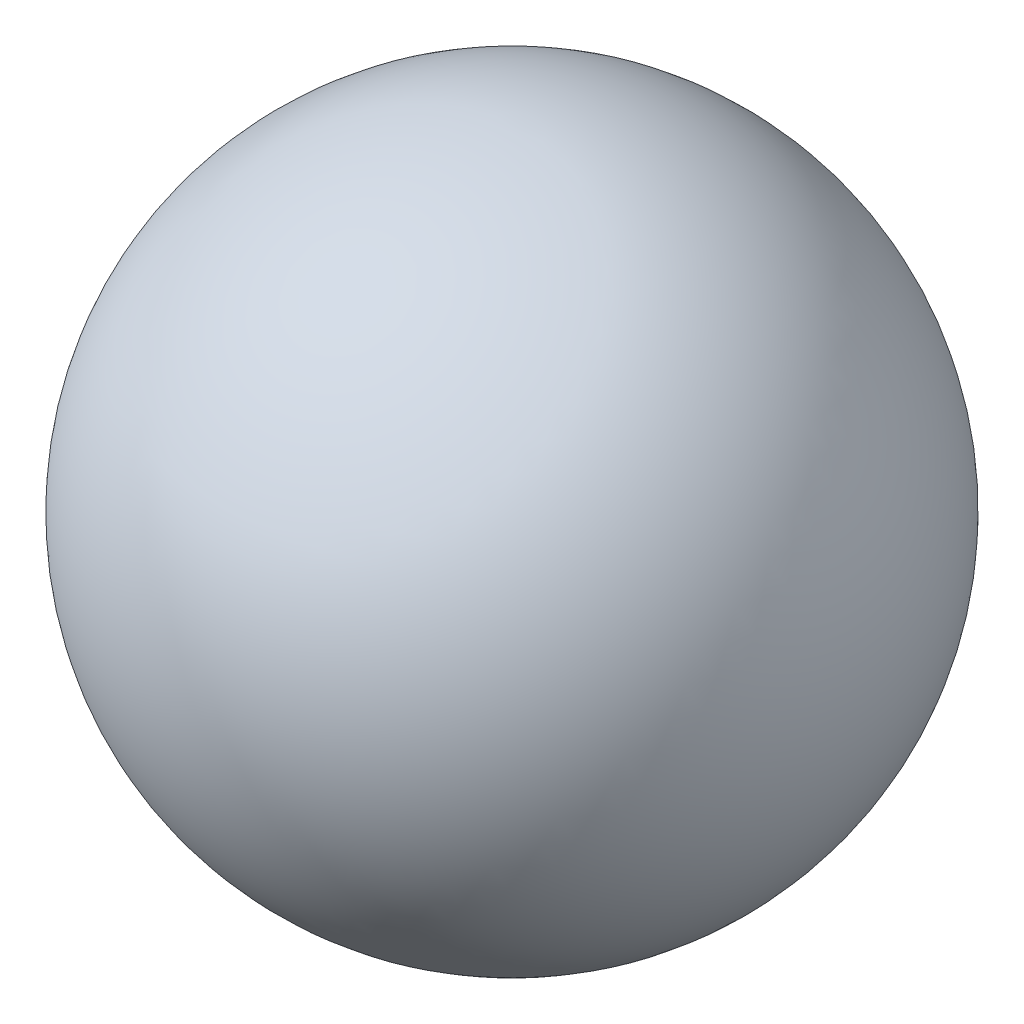
ISO-10303-21;
HEADER;
FILE_DESCRIPTION(('STEP AP214'),'2;1');
FILE_NAME('part.step','',(''),(''),'','','');
FILE_SCHEMA(('AUTOMOTIVE_DESIGN { 1 0 10303 214 1 1 1 1 }'));
ENDSEC;
DATA;
#1=APPLICATION_CONTEXT('core data for automotive mechanical design processes');
#2=APPLICATION_PROTOCOL_DEFINITION('international standard','automotive_design',2000,#1);
#3=PRODUCT_CONTEXT('',#1,'mechanical');
#4=PRODUCT('Part','Part','',(#3));
#5=PRODUCT_RELATED_PRODUCT_CATEGORY('part','',(#4));
#6=PRODUCT_DEFINITION_FORMATION('','',#4);
#7=PRODUCT_DEFINITION_CONTEXT('part definition',#1,'design');
#8=PRODUCT_DEFINITION('design','',#6,#7);
#9=PRODUCT_DEFINITION_SHAPE('','',#8);
#10=(LENGTH_UNIT() NAMED_UNIT(*) SI_UNIT(.MILLI.,.METRE.));
#11=(NAMED_UNIT(*) PLANE_ANGLE_UNIT() SI_UNIT($,.RADIAN.));
#12=(NAMED_UNIT(*) SI_UNIT($,.STERADIAN.) SOLID_ANGLE_UNIT());
#13=UNCERTAINTY_MEASURE_WITH_UNIT(LENGTH_MEASURE(1.E-05),#10,'distance_accuracy_value','');
#14=(GEOMETRIC_REPRESENTATION_CONTEXT(3) GLOBAL_UNCERTAINTY_ASSIGNED_CONTEXT((#13)) GLOBAL_UNIT_ASSIGNED_CONTEXT((#10,
#11,#12)) REPRESENTATION_CONTEXT('',''));
#15=CARTESIAN_POINT('',(0.,0.,0.));
#16=DIRECTION('',(0.,0.,1.));
#17=DIRECTION('',(1.,0.,0.));
#18=AXIS2_PLACEMENT_3D('',#15,#16,#17);
#19=CARTESIAN_POINT('',(0.,0.,0.));
#20=DIRECTION('',(0.,1.,0.));
#21=DIRECTION('',(1.,0.,0.));
#22=AXIS2_PLACEMENT_3D('',#19,#20,#21);
#23=SPHERICAL_SURFACE('',#22,1.5875);
#24=CARTESIAN_POINT('',(0.,-1.37983017876114,0.));
#25=DIRECTION('',(0.,1.,0.));
#26=DIRECTION('',(0.,0.,1.));
#27=AXIS2_PLACEMENT_3D('',#24,#25,#26);
#28=CIRCLE('',#27,0.784999954);
#29=CARTESIAN_POINT('',(0.,-1.37983017876114,0.784999954));
#30=VERTEX_POINT('',#29);
#31=EDGE_CURVE('E11',#30,#30,#28,.T.);
#32=ORIENTED_EDGE('',*,*,#31,.T.);
#33=EDGE_LOOP('',(#32));
#34=FACE_BOUND('',#33,.T.);
#35=ADVANCED_FACE('F38',(#34),#23,.T.);
#36=CARTESIAN_POINT('',(0.,-1.5875,0.));
#37=DIRECTION('',(0.,-1.,0.));
#38=DIRECTION('',(0.,0.,-1.));
#39=AXIS2_PLACEMENT_3D('',#36,#37,#38);
#40=CYLINDRICAL_SURFACE('',#39,0.784999954);
#41=CARTESIAN_POINT('',(0.,0.00250000000000011,0.));
#42=DIRECTION('',(0.,-1.,0.));
#43=DIRECTION('',(0.,0.,-1.));
#44=AXIS2_PLACEMENT_3D('',#41,#42,#43);
#45=CIRCLE('',#44,0.784999954);
#46=CARTESIAN_POINT('',(0.,0.00250000000000011,-0.784999954));
#47=VERTEX_POINT('',#46);
#48=EDGE_CURVE('E44',#47,#47,#45,.T.);
#49=ORIENTED_EDGE('',*,*,#48,.F.);
#50=EDGE_LOOP('',(#49));
#51=FACE_BOUND('',#50,.T.);
#52=ORIENTED_EDGE('',*,*,#31,.F.);
#53=EDGE_LOOP('',(#52));
#54=FACE_BOUND('',#53,.T.);
#55=ADVANCED_FACE('F50',(#51,#54),#40,.F.);
#56=CARTESIAN_POINT('',(0.,0.00250000000000011,0.));
#57=DIRECTION('',(0.,-1.,0.));
#58=DIRECTION('',(0.,0.,-1.));
#59=AXIS2_PLACEMENT_3D('',#56,#57,#58);
#60=CONICAL_SURFACE('',#59,0.784999954,1.02974425867665);
#61=CARTESIAN_POINT('',(0.,0.474175558297046,0.));
#62=VERTEX_POINT('',#61);
#63=VERTEX_LOOP('',#62);
#64=FACE_BOUND('',#63,.T.);
#65=ORIENTED_EDGE('',*,*,#48,.T.);
#66=EDGE_LOOP('',(#65));
#67=FACE_BOUND('',#66,.T.);
#68=ADVANCED_FACE('F47',(#64,#67),#60,.F.);
#69=CLOSED_SHELL('',(#35,#55,#68));
#70=MANIFOLD_SOLID_BREP('B2',#69);
#71=ADVANCED_BREP_SHAPE_REPRESENTATION('',(#18,#70),#14);
#72=SHAPE_DEFINITION_REPRESENTATION(#9,#71);
ENDSEC;
END-ISO-10303-21;
